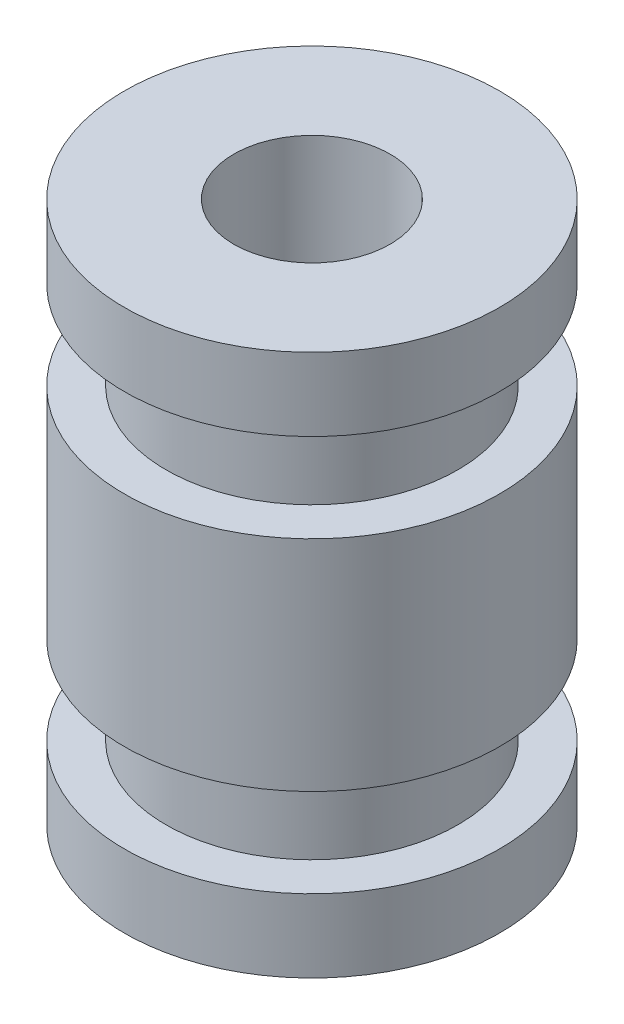
ISO-10303-21;
HEADER;
FILE_DESCRIPTION(('STEP AP214'),'2;1');
FILE_NAME('part.step','',(''),(''),'','','');
FILE_SCHEMA(('AUTOMOTIVE_DESIGN { 1 0 10303 214 1 1 1 1 }'));
ENDSEC;
DATA;
#1=APPLICATION_CONTEXT('core data for automotive mechanical design processes');
#2=APPLICATION_PROTOCOL_DEFINITION('international standard','automotive_design',2000,#1);
#3=PRODUCT_CONTEXT('',#1,'mechanical');
#4=PRODUCT('Part','Part','',(#3));
#5=PRODUCT_RELATED_PRODUCT_CATEGORY('part','',(#4));
#6=PRODUCT_DEFINITION_FORMATION('','',#4);
#7=PRODUCT_DEFINITION_CONTEXT('part definition',#1,'design');
#8=PRODUCT_DEFINITION('design','',#6,#7);
#9=PRODUCT_DEFINITION_SHAPE('','',#8);
#10=(LENGTH_UNIT() NAMED_UNIT(*) SI_UNIT(.MILLI.,.METRE.));
#11=(NAMED_UNIT(*) PLANE_ANGLE_UNIT() SI_UNIT($,.RADIAN.));
#12=(NAMED_UNIT(*) SI_UNIT($,.STERADIAN.) SOLID_ANGLE_UNIT());
#13=UNCERTAINTY_MEASURE_WITH_UNIT(LENGTH_MEASURE(1.E-05),#10,'distance_accuracy_value','');
#14=(GEOMETRIC_REPRESENTATION_CONTEXT(3) GLOBAL_UNCERTAINTY_ASSIGNED_CONTEXT((#13)) GLOBAL_UNIT_ASSIGNED_CONTEXT((#10,
#11,#12)) REPRESENTATION_CONTEXT('',''));
#15=CARTESIAN_POINT('',(0.,0.,0.));
#16=DIRECTION('',(0.,0.,1.));
#17=DIRECTION('',(1.,0.,0.));
#18=AXIS2_PLACEMENT_3D('',#15,#16,#17);
#19=CARTESIAN_POINT('',(4.5,0.,0.));
#20=DIRECTION('',(0.,-1.,0.));
#21=DIRECTION('',(0.,0.,-1.));
#22=AXIS2_PLACEMENT_3D('',#19,#20,#21);
#23=PLANE('',#22);
#24=CARTESIAN_POINT('',(0.,0.,0.));
#25=DIRECTION('',(0.,1.,0.));
#26=DIRECTION('',(0.,0.,1.));
#27=AXIS2_PLACEMENT_3D('',#24,#25,#26);
#28=CIRCLE('',#27,1.875);
#29=CARTESIAN_POINT('',(0.,0.,1.875));
#30=VERTEX_POINT('',#29);
#31=EDGE_CURVE('E84',#30,#30,#28,.T.);
#32=ORIENTED_EDGE('',*,*,#31,.T.);
#33=EDGE_LOOP('',(#32));
#34=FACE_BOUND('',#33,.T.);
#35=CARTESIAN_POINT('',(0.,0.,0.));
#36=DIRECTION('',(0.,-1.,0.));
#37=DIRECTION('',(0.,0.,-1.));
#38=AXIS2_PLACEMENT_3D('',#35,#36,#37);
#39=CIRCLE('',#38,4.5);
#40=CARTESIAN_POINT('',(0.,0.,-4.5));
#41=VERTEX_POINT('',#40);
#42=EDGE_CURVE('E80',#41,#41,#39,.T.);
#43=ORIENTED_EDGE('',*,*,#42,.T.);
#44=EDGE_LOOP('',(#43));
#45=FACE_BOUND('',#44,.T.);
#46=ADVANCED_FACE('F37',(#34,#45),#23,.T.);
#47=CARTESIAN_POINT('',(0.,13.,0.));
#48=DIRECTION('',(0.,1.,0.));
#49=DIRECTION('',(0.,0.,1.));
#50=AXIS2_PLACEMENT_3D('',#47,#48,#49);
#51=PLANE('',#50);
#52=CARTESIAN_POINT('',(0.,13.,0.));
#53=DIRECTION('',(0.,1.,0.));
#54=DIRECTION('',(0.,0.,1.));
#55=AXIS2_PLACEMENT_3D('',#52,#53,#54);
#56=CIRCLE('',#55,1.875);
#57=CARTESIAN_POINT('',(0.,13.,1.875));
#58=VERTEX_POINT('',#57);
#59=EDGE_CURVE('E40',#58,#58,#56,.T.);
#60=ORIENTED_EDGE('',*,*,#59,.F.);
#61=EDGE_LOOP('',(#60));
#62=FACE_BOUND('',#61,.T.);
#63=CARTESIAN_POINT('',(0.,13.,0.));
#64=DIRECTION('',(0.,-1.,0.));
#65=DIRECTION('',(0.,0.,-1.));
#66=AXIS2_PLACEMENT_3D('',#63,#64,#65);
#67=CIRCLE('',#66,4.5);
#68=CARTESIAN_POINT('',(0.,13.,-4.5));
#69=VERTEX_POINT('',#68);
#70=EDGE_CURVE('E10',#69,#69,#67,.T.);
#71=ORIENTED_EDGE('',*,*,#70,.F.);
#72=EDGE_LOOP('',(#71));
#73=FACE_BOUND('',#72,.T.);
#74=ADVANCED_FACE('F96',(#62,#73),#51,.T.);
#75=CARTESIAN_POINT('',(0.,0.,0.));
#76=DIRECTION('',(0.,-1.,0.));
#77=DIRECTION('',(0.,0.,-1.));
#78=AXIS2_PLACEMENT_3D('',#75,#76,#77);
#79=CYLINDRICAL_SURFACE('',#78,4.5);
#80=ORIENTED_EDGE('',*,*,#70,.T.);
#81=EDGE_LOOP('',(#80));
#82=FACE_BOUND('',#81,.T.);
#83=CARTESIAN_POINT('',(0.,11.25,0.));
#84=DIRECTION('',(0.,-1.,0.));
#85=DIRECTION('',(0.,0.,-1.));
#86=AXIS2_PLACEMENT_3D('',#83,#84,#85);
#87=CIRCLE('',#86,4.5);
#88=CARTESIAN_POINT('',(0.,11.25,-4.5));
#89=VERTEX_POINT('',#88);
#90=EDGE_CURVE('E45',#89,#89,#87,.T.);
#91=ORIENTED_EDGE('',*,*,#90,.F.);
#92=EDGE_LOOP('',(#91));
#93=FACE_BOUND('',#92,.T.);
#94=ADVANCED_FACE('F99',(#82,#93),#79,.T.);
#95=CARTESIAN_POINT('',(4.5,11.25,0.));
#96=DIRECTION('',(0.,-1.,0.));
#97=DIRECTION('',(0.,0.,-1.));
#98=AXIS2_PLACEMENT_3D('',#95,#96,#97);
#99=PLANE('',#98);
#100=ORIENTED_EDGE('',*,*,#90,.T.);
#101=EDGE_LOOP('',(#100));
#102=FACE_BOUND('',#101,.T.);
#103=CARTESIAN_POINT('',(0.,11.25,0.));
#104=DIRECTION('',(0.,-1.,0.));
#105=DIRECTION('',(0.,0.,-1.));
#106=AXIS2_PLACEMENT_3D('',#103,#104,#105);
#107=CIRCLE('',#106,3.5);
#108=CARTESIAN_POINT('',(0.,11.25,-3.5));
#109=VERTEX_POINT('',#108);
#110=EDGE_CURVE('E50',#109,#109,#107,.T.);
#111=ORIENTED_EDGE('',*,*,#110,.F.);
#112=EDGE_LOOP('',(#111));
#113=FACE_BOUND('',#112,.T.);
#114=ADVANCED_FACE('F104',(#102,#113),#99,.T.);
#115=CARTESIAN_POINT('',(0.,0.,0.));
#116=DIRECTION('',(0.,-1.,0.));
#117=DIRECTION('',(0.,0.,-1.));
#118=AXIS2_PLACEMENT_3D('',#115,#116,#117);
#119=CYLINDRICAL_SURFACE('',#118,3.5);
#120=ORIENTED_EDGE('',*,*,#110,.T.);
#121=EDGE_LOOP('',(#120));
#122=FACE_BOUND('',#121,.T.);
#123=CARTESIAN_POINT('',(0.,9.125,0.));
#124=DIRECTION('',(0.,-1.,0.));
#125=DIRECTION('',(0.,0.,-1.));
#126=AXIS2_PLACEMENT_3D('',#123,#124,#125);
#127=CIRCLE('',#126,3.5);
#128=CARTESIAN_POINT('',(0.,9.125,-3.5));
#129=VERTEX_POINT('',#128);
#130=EDGE_CURVE('E56',#129,#129,#127,.T.);
#131=ORIENTED_EDGE('',*,*,#130,.F.);
#132=EDGE_LOOP('',(#131));
#133=FACE_BOUND('',#132,.T.);
#134=ADVANCED_FACE('F109',(#122,#133),#119,.T.);
#135=CARTESIAN_POINT('',(3.5,9.125,0.));
#136=DIRECTION('',(0.,1.,0.));
#137=DIRECTION('',(0.,0.,1.));
#138=AXIS2_PLACEMENT_3D('',#135,#136,#137);
#139=PLANE('',#138);
#140=ORIENTED_EDGE('',*,*,#130,.T.);
#141=EDGE_LOOP('',(#140));
#142=FACE_BOUND('',#141,.T.);
#143=CARTESIAN_POINT('',(0.,9.125,0.));
#144=DIRECTION('',(0.,-1.,0.));
#145=DIRECTION('',(0.,0.,-1.));
#146=AXIS2_PLACEMENT_3D('',#143,#144,#145);
#147=CIRCLE('',#146,4.5);
#148=CARTESIAN_POINT('',(0.,9.125,-4.5));
#149=VERTEX_POINT('',#148);
#150=EDGE_CURVE('E60',#149,#149,#147,.T.);
#151=ORIENTED_EDGE('',*,*,#150,.F.);
#152=EDGE_LOOP('',(#151));
#153=FACE_BOUND('',#152,.T.);
#154=ADVANCED_FACE('F113',(#142,#153),#139,.T.);
#155=CARTESIAN_POINT('',(0.,0.,0.));
#156=DIRECTION('',(0.,-1.,0.));
#157=DIRECTION('',(0.,0.,-1.));
#158=AXIS2_PLACEMENT_3D('',#155,#156,#157);
#159=CYLINDRICAL_SURFACE('',#158,4.5);
#160=ORIENTED_EDGE('',*,*,#150,.T.);
#161=EDGE_LOOP('',(#160));
#162=FACE_BOUND('',#161,.T.);
#163=CARTESIAN_POINT('',(0.,3.875,0.));
#164=DIRECTION('',(0.,-1.,0.));
#165=DIRECTION('',(0.,0.,-1.));
#166=AXIS2_PLACEMENT_3D('',#163,#164,#165);
#167=CIRCLE('',#166,4.5);
#168=CARTESIAN_POINT('',(0.,3.875,-4.5));
#169=VERTEX_POINT('',#168);
#170=EDGE_CURVE('E64',#169,#169,#167,.T.);
#171=ORIENTED_EDGE('',*,*,#170,.F.);
#172=EDGE_LOOP('',(#171));
#173=FACE_BOUND('',#172,.T.);
#174=ADVANCED_FACE('F117',(#162,#173),#159,.T.);
#175=CARTESIAN_POINT('',(4.5,3.875,0.));
#176=DIRECTION('',(0.,-1.,0.));
#177=DIRECTION('',(0.,0.,-1.));
#178=AXIS2_PLACEMENT_3D('',#175,#176,#177);
#179=PLANE('',#178);
#180=ORIENTED_EDGE('',*,*,#170,.T.);
#181=EDGE_LOOP('',(#180));
#182=FACE_BOUND('',#181,.T.);
#183=CARTESIAN_POINT('',(0.,3.875,0.));
#184=DIRECTION('',(0.,-1.,0.));
#185=DIRECTION('',(0.,0.,-1.));
#186=AXIS2_PLACEMENT_3D('',#183,#184,#185);
#187=CIRCLE('',#186,3.5);
#188=CARTESIAN_POINT('',(0.,3.875,-3.5));
#189=VERTEX_POINT('',#188);
#190=EDGE_CURVE('E68',#189,#189,#187,.T.);
#191=ORIENTED_EDGE('',*,*,#190,.F.);
#192=EDGE_LOOP('',(#191));
#193=FACE_BOUND('',#192,.T.);
#194=ADVANCED_FACE('F121',(#182,#193),#179,.T.);
#195=CARTESIAN_POINT('',(0.,0.,0.));
#196=DIRECTION('',(0.,-1.,0.));
#197=DIRECTION('',(0.,0.,-1.));
#198=AXIS2_PLACEMENT_3D('',#195,#196,#197);
#199=CYLINDRICAL_SURFACE('',#198,3.5);
#200=ORIENTED_EDGE('',*,*,#190,.T.);
#201=EDGE_LOOP('',(#200));
#202=FACE_BOUND('',#201,.T.);
#203=CARTESIAN_POINT('',(0.,1.75,0.));
#204=DIRECTION('',(0.,-1.,0.));
#205=DIRECTION('',(0.,0.,-1.));
#206=AXIS2_PLACEMENT_3D('',#203,#204,#205);
#207=CIRCLE('',#206,3.5);
#208=CARTESIAN_POINT('',(0.,1.75,-3.5));
#209=VERTEX_POINT('',#208);
#210=EDGE_CURVE('E72',#209,#209,#207,.T.);
#211=ORIENTED_EDGE('',*,*,#210,.F.);
#212=EDGE_LOOP('',(#211));
#213=FACE_BOUND('',#212,.T.);
#214=ADVANCED_FACE('F125',(#202,#213),#199,.T.);
#215=CARTESIAN_POINT('',(3.5,1.75,0.));
#216=DIRECTION('',(0.,1.,0.));
#217=DIRECTION('',(0.,0.,1.));
#218=AXIS2_PLACEMENT_3D('',#215,#216,#217);
#219=PLANE('',#218);
#220=ORIENTED_EDGE('',*,*,#210,.T.);
#221=EDGE_LOOP('',(#220));
#222=FACE_BOUND('',#221,.T.);
#223=CARTESIAN_POINT('',(0.,1.75,0.));
#224=DIRECTION('',(0.,-1.,0.));
#225=DIRECTION('',(0.,0.,-1.));
#226=AXIS2_PLACEMENT_3D('',#223,#224,#225);
#227=CIRCLE('',#226,4.5);
#228=CARTESIAN_POINT('',(0.,1.75,-4.5));
#229=VERTEX_POINT('',#228);
#230=EDGE_CURVE('E76',#229,#229,#227,.T.);
#231=ORIENTED_EDGE('',*,*,#230,.F.);
#232=EDGE_LOOP('',(#231));
#233=FACE_BOUND('',#232,.T.);
#234=ADVANCED_FACE('F129',(#222,#233),#219,.T.);
#235=CARTESIAN_POINT('',(0.,0.,0.));
#236=DIRECTION('',(0.,-1.,0.));
#237=DIRECTION('',(0.,0.,-1.));
#238=AXIS2_PLACEMENT_3D('',#235,#236,#237);
#239=CYLINDRICAL_SURFACE('',#238,4.5);
#240=ORIENTED_EDGE('',*,*,#230,.T.);
#241=EDGE_LOOP('',(#240));
#242=FACE_BOUND('',#241,.T.);
#243=ORIENTED_EDGE('',*,*,#42,.F.);
#244=EDGE_LOOP('',(#243));
#245=FACE_BOUND('',#244,.T.);
#246=ADVANCED_FACE('F133',(#242,#245),#239,.T.);
#247=CARTESIAN_POINT('',(0.,0.,0.));
#248=DIRECTION('',(0.,1.,0.));
#249=DIRECTION('',(0.,0.,1.));
#250=AXIS2_PLACEMENT_3D('',#247,#248,#249);
#251=CYLINDRICAL_SURFACE('',#250,1.875);
#252=ORIENTED_EDGE('',*,*,#59,.T.);
#253=EDGE_LOOP('',(#252));
#254=FACE_BOUND('',#253,.T.);
#255=ORIENTED_EDGE('',*,*,#31,.F.);
#256=EDGE_LOOP('',(#255));
#257=FACE_BOUND('',#256,.T.);
#258=ADVANCED_FACE('F93',(#254,#257),#251,.F.);
#259=CLOSED_SHELL('',(#46,#74,#94,#114,#134,#154,#174,#194,#214,#234,#246,#258));
#260=MANIFOLD_SOLID_BREP('B2',#259);
#261=ADVANCED_BREP_SHAPE_REPRESENTATION('',(#18,#260),#14);
#262=SHAPE_DEFINITION_REPRESENTATION(#9,#261);
ENDSEC;
END-ISO-10303-21;
